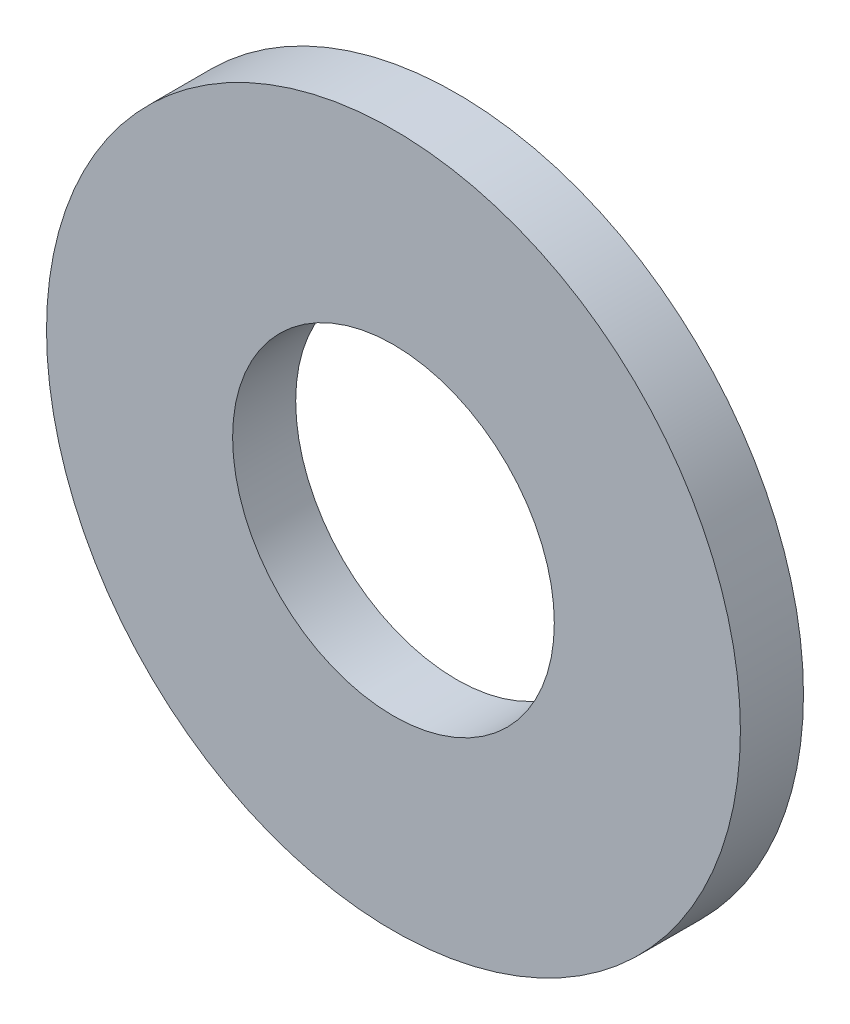
ISO-10303-21;
HEADER;
FILE_DESCRIPTION(('STEP AP214'),'2;1');
FILE_NAME('part.step','',(''),(''),'','','');
FILE_SCHEMA(('AUTOMOTIVE_DESIGN { 1 0 10303 214 1 1 1 1 }'));
ENDSEC;
DATA;
#1=APPLICATION_CONTEXT('core data for automotive mechanical design processes');
#2=APPLICATION_PROTOCOL_DEFINITION('international standard','automotive_design',2000,#1);
#3=PRODUCT_CONTEXT('',#1,'mechanical');
#4=PRODUCT('Part','Part','',(#3));
#5=PRODUCT_RELATED_PRODUCT_CATEGORY('part','',(#4));
#6=PRODUCT_DEFINITION_FORMATION('','',#4);
#7=PRODUCT_DEFINITION_CONTEXT('part definition',#1,'design');
#8=PRODUCT_DEFINITION('design','',#6,#7);
#9=PRODUCT_DEFINITION_SHAPE('','',#8);
#10=(LENGTH_UNIT() NAMED_UNIT(*) SI_UNIT(.MILLI.,.METRE.));
#11=(NAMED_UNIT(*) PLANE_ANGLE_UNIT() SI_UNIT($,.RADIAN.));
#12=(NAMED_UNIT(*) SI_UNIT($,.STERADIAN.) SOLID_ANGLE_UNIT());
#13=UNCERTAINTY_MEASURE_WITH_UNIT(LENGTH_MEASURE(1.E-05),#10,'distance_accuracy_value','');
#14=(GEOMETRIC_REPRESENTATION_CONTEXT(3) GLOBAL_UNCERTAINTY_ASSIGNED_CONTEXT((#13)) GLOBAL_UNIT_ASSIGNED_CONTEXT((#10,
#11,#12)) REPRESENTATION_CONTEXT('',''));
#15=CARTESIAN_POINT('',(0.,0.,0.));
#16=DIRECTION('',(0.,0.,1.));
#17=DIRECTION('',(1.,0.,0.));
#18=AXIS2_PLACEMENT_3D('',#15,#16,#17);
#19=CARTESIAN_POINT('',(0.,0.,0.));
#20=DIRECTION('',(0.,0.,1.));
#21=DIRECTION('',(1.,0.,0.));
#22=AXIS2_PLACEMENT_3D('',#19,#20,#21);
#23=CYLINDRICAL_SURFACE('',#22,2.55);
#24=CARTESIAN_POINT('',(0.,0.,1.));
#25=DIRECTION('',(0.,0.,-1.));
#26=DIRECTION('',(0.,-1.,0.));
#27=AXIS2_PLACEMENT_3D('',#24,#25,#26);
#28=CIRCLE('',#27,2.55);
#29=CARTESIAN_POINT('',(0.,-2.55,1.));
#30=VERTEX_POINT('',#29);
#31=EDGE_CURVE('E10',#30,#30,#28,.T.);
#32=ORIENTED_EDGE('',*,*,#31,.F.);
#33=EDGE_LOOP('',(#32));
#34=FACE_BOUND('',#33,.T.);
#35=CARTESIAN_POINT('',(0.,0.,0.));
#36=DIRECTION('',(0.,0.,1.));
#37=DIRECTION('',(1.,0.,0.));
#38=AXIS2_PLACEMENT_3D('',#35,#36,#37);
#39=CIRCLE('',#38,2.55);
#40=CARTESIAN_POINT('',(2.55,0.,0.));
#41=VERTEX_POINT('',#40);
#42=EDGE_CURVE('E27',#41,#41,#39,.T.);
#43=ORIENTED_EDGE('',*,*,#42,.F.);
#44=EDGE_LOOP('',(#43));
#45=FACE_BOUND('',#44,.T.);
#46=ADVANCED_FACE('F14',(#34,#45),#23,.F.);
#47=CARTESIAN_POINT('',(0.,0.,0.));
#48=DIRECTION('',(0.,0.,1.));
#49=DIRECTION('',(1.,0.,0.));
#50=AXIS2_PLACEMENT_3D('',#47,#48,#49);
#51=CYLINDRICAL_SURFACE('',#50,5.5);
#52=CARTESIAN_POINT('',(0.,0.,1.));
#53=DIRECTION('',(0.,0.,1.));
#54=DIRECTION('',(1.,0.,0.));
#55=AXIS2_PLACEMENT_3D('',#52,#53,#54);
#56=CIRCLE('',#55,5.5);
#57=CARTESIAN_POINT('',(5.5,0.,1.));
#58=VERTEX_POINT('',#57);
#59=EDGE_CURVE('E22',#58,#58,#56,.T.);
#60=ORIENTED_EDGE('',*,*,#59,.F.);
#61=EDGE_LOOP('',(#60));
#62=FACE_BOUND('',#61,.T.);
#63=CARTESIAN_POINT('',(0.,0.,0.));
#64=DIRECTION('',(0.,0.,-1.));
#65=DIRECTION('',(0.,-1.,0.));
#66=AXIS2_PLACEMENT_3D('',#63,#64,#65);
#67=CIRCLE('',#66,5.5);
#68=CARTESIAN_POINT('',(0.,-5.5,0.));
#69=VERTEX_POINT('',#68);
#70=EDGE_CURVE('E18',#69,#69,#67,.T.);
#71=ORIENTED_EDGE('',*,*,#70,.F.);
#72=EDGE_LOOP('',(#71));
#73=FACE_BOUND('',#72,.T.);
#74=ADVANCED_FACE('F16',(#62,#73),#51,.T.);
#75=CARTESIAN_POINT('',(0.,0.,1.));
#76=DIRECTION('',(0.,0.,1.));
#77=DIRECTION('',(1.,0.,0.));
#78=AXIS2_PLACEMENT_3D('',#75,#76,#77);
#79=PLANE('',#78);
#80=ORIENTED_EDGE('',*,*,#31,.T.);
#81=EDGE_LOOP('',(#80));
#82=FACE_BOUND('',#81,.T.);
#83=ORIENTED_EDGE('',*,*,#59,.T.);
#84=EDGE_LOOP('',(#83));
#85=FACE_BOUND('',#84,.T.);
#86=ADVANCED_FACE('F38',(#82,#85),#79,.T.);
#87=CARTESIAN_POINT('',(0.,0.,0.));
#88=DIRECTION('',(0.,0.,1.));
#89=DIRECTION('',(1.,0.,0.));
#90=AXIS2_PLACEMENT_3D('',#87,#88,#89);
#91=PLANE('',#90);
#92=ORIENTED_EDGE('',*,*,#42,.T.);
#93=EDGE_LOOP('',(#92));
#94=FACE_BOUND('',#93,.T.);
#95=ORIENTED_EDGE('',*,*,#70,.T.);
#96=EDGE_LOOP('',(#95));
#97=FACE_BOUND('',#96,.T.);
#98=ADVANCED_FACE('F35',(#94,#97),#91,.F.);
#99=CLOSED_SHELL('',(#46,#74,#86,#98));
#100=MANIFOLD_SOLID_BREP('B1',#99);
#101=ADVANCED_BREP_SHAPE_REPRESENTATION('',(#18,#100),#14);
#102=SHAPE_DEFINITION_REPRESENTATION(#9,#101);
ENDSEC;
END-ISO-10303-21;
